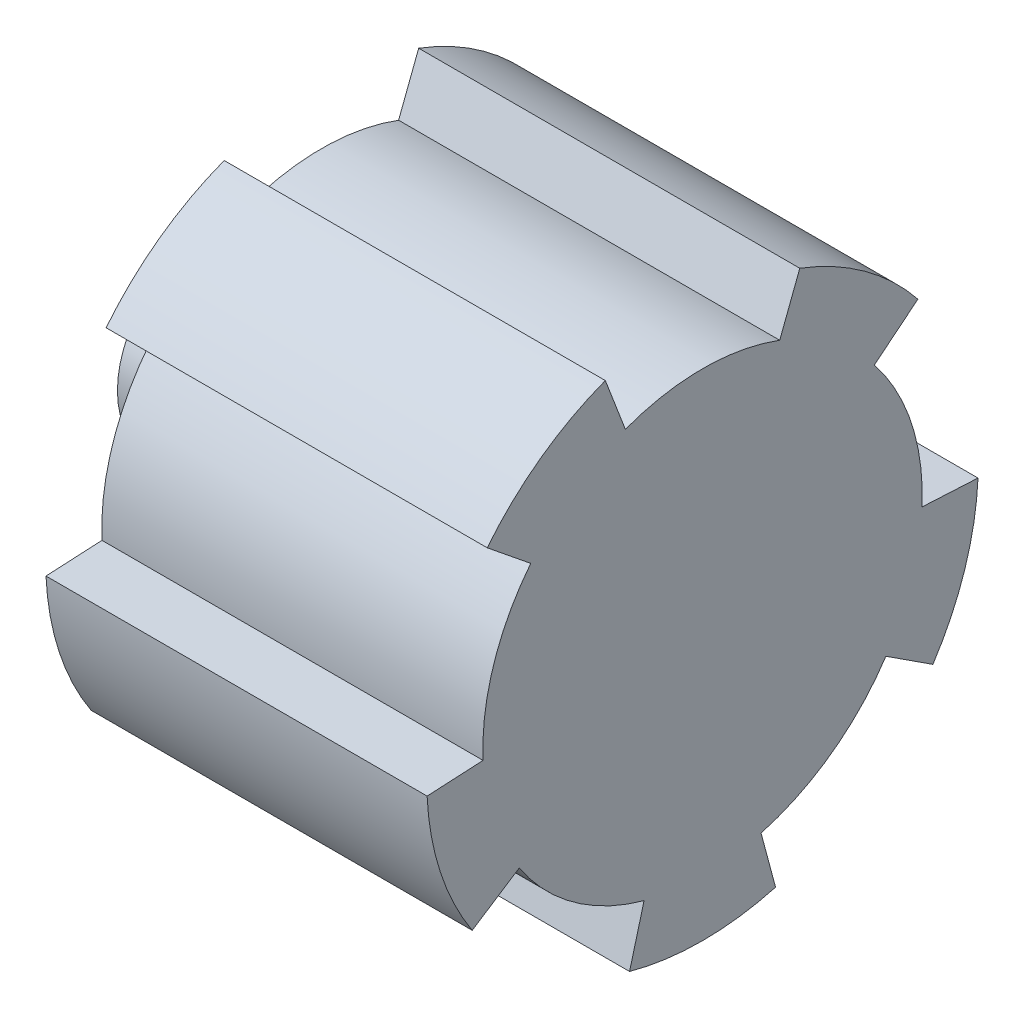
ISO-10303-21;
HEADER;
FILE_DESCRIPTION(('STEP AP214'),'2;1');
FILE_NAME('part.step','',(''),(''),'','','');
FILE_SCHEMA(('AUTOMOTIVE_DESIGN { 1 0 10303 214 1 1 1 1 }'));
ENDSEC;
DATA;
#1=APPLICATION_CONTEXT('core data for automotive mechanical design processes');
#2=APPLICATION_PROTOCOL_DEFINITION('international standard','automotive_design',2000,#1);
#3=PRODUCT_CONTEXT('',#1,'mechanical');
#4=PRODUCT('Part','Part','',(#3));
#5=PRODUCT_RELATED_PRODUCT_CATEGORY('part','',(#4));
#6=PRODUCT_DEFINITION_FORMATION('','',#4);
#7=PRODUCT_DEFINITION_CONTEXT('part definition',#1,'design');
#8=PRODUCT_DEFINITION('design','',#6,#7);
#9=PRODUCT_DEFINITION_SHAPE('','',#8);
#10=(LENGTH_UNIT() NAMED_UNIT(*) SI_UNIT(.MILLI.,.METRE.));
#11=(NAMED_UNIT(*) PLANE_ANGLE_UNIT() SI_UNIT($,.RADIAN.));
#12=(NAMED_UNIT(*) SI_UNIT($,.STERADIAN.) SOLID_ANGLE_UNIT());
#13=UNCERTAINTY_MEASURE_WITH_UNIT(LENGTH_MEASURE(1.E-05),#10,'distance_accuracy_value','');
#14=(GEOMETRIC_REPRESENTATION_CONTEXT(3) GLOBAL_UNCERTAINTY_ASSIGNED_CONTEXT((#13)) GLOBAL_UNIT_ASSIGNED_CONTEXT((#10,
#11,#12)) REPRESENTATION_CONTEXT('',''));
#15=CARTESIAN_POINT('',(0.,0.,0.));
#16=DIRECTION('',(0.,0.,1.));
#17=DIRECTION('',(1.,0.,0.));
#18=AXIS2_PLACEMENT_3D('',#15,#16,#17);
#19=CARTESIAN_POINT('',(-35.,0.,0.));
#20=DIRECTION('',(1.,0.,0.));
#21=DIRECTION('',(0.,0.,-1.));
#22=AXIS2_PLACEMENT_3D('',#19,#20,#21);
#23=CYLINDRICAL_SURFACE('',#22,9.8);
#24=CARTESIAN_POINT('',(-18.,0.,0.));
#25=DIRECTION('',(-1.,0.,0.));
#26=DIRECTION('',(0.,0.,1.));
#27=AXIS2_PLACEMENT_3D('',#24,#25,#26);
#28=CIRCLE('',#27,9.8);
#29=CARTESIAN_POINT('',(-18.,9.17573856950324,3.44177595205304));
#30=VERTEX_POINT('',#29);
#31=CARTESIAN_POINT('',(-18.,9.17573856950324,-3.44177595205303));
#32=VERTEX_POINT('',#31);
#33=EDGE_CURVE('E204',#30,#32,#28,.T.);
#34=ORIENTED_EDGE('',*,*,#33,.T.);
#35=DIRECTION('',(1.,0.,0.));
#36=VECTOR('',#35,1.);
#37=CARTESIAN_POINT('',(-35.,9.17573856950324,-3.44177595205303));
#38=LINE('',#37,#36);
#39=CARTESIAN_POINT('',(-35.,9.17573856950324,-3.44177595205303));
#40=VERTEX_POINT('',#39);
#41=EDGE_CURVE('E37',#40,#32,#38,.T.);
#42=ORIENTED_EDGE('',*,*,#41,.F.);
#43=CARTESIAN_POINT('',(-35.,0.,0.));
#44=DIRECTION('',(-1.,0.,0.));
#45=DIRECTION('',(0.,0.,1.));
#46=AXIS2_PLACEMENT_3D('',#43,#44,#45);
#47=CIRCLE('',#46,9.8);
#48=CARTESIAN_POINT('',(-35.,9.17573856950324,3.44177595205304));
#49=VERTEX_POINT('',#48);
#50=EDGE_CURVE('E243',#49,#40,#47,.T.);
#51=ORIENTED_EDGE('',*,*,#50,.F.);
#52=DIRECTION('',(1.,0.,0.));
#53=VECTOR('',#52,1.);
#54=CARTESIAN_POINT('',(-35.,9.17573856950324,3.44177595205304));
#55=LINE('',#54,#53);
#56=EDGE_CURVE('E200',#49,#30,#55,.T.);
#57=ORIENTED_EDGE('',*,*,#56,.T.);
#58=EDGE_LOOP('',(#34,#42,#51,#57));
#59=FACE_BOUND('',#58,.T.);
#60=ADVANCED_FACE('F34',(#59),#23,.T.);
#61=CARTESIAN_POINT('',(-35.,9.17573856950324,-3.44177595205303));
#62=DIRECTION('',(0.,-0.358367949545299,-0.933580426497202));
#63=DIRECTION('',(0.,0.933580426497203,-0.358367949545299));
#64=AXIS2_PLACEMENT_3D('',#61,#62,#63);
#65=PLANE('',#64);
#66=DIRECTION('',(0.,0.933580426497202,-0.358367949545299));
#67=VECTOR('',#66,1.);
#68=CARTESIAN_POINT('',(-18.,9.17573856950324,-3.44177595205303));
#69=LINE('',#68,#67);
#70=CARTESIAN_POINT('',(-18.,11.5090374790781,-4.33744548642617));
#71=VERTEX_POINT('',#70);
#72=EDGE_CURVE('E207',#32,#71,#69,.T.);
#73=ORIENTED_EDGE('',*,*,#72,.T.);
#74=DIRECTION('',(1.,0.,0.));
#75=VECTOR('',#74,1.);
#76=CARTESIAN_POINT('',(-35.,11.5090374790781,-4.33744548642617));
#77=LINE('',#76,#75);
#78=CARTESIAN_POINT('',(-35.,11.5090374790781,-4.33744548642617));
#79=VERTEX_POINT('',#78);
#80=EDGE_CURVE('E288',#79,#71,#77,.T.);
#81=ORIENTED_EDGE('',*,*,#80,.F.);
#82=DIRECTION('',(0.,0.933580426497202,-0.358367949545299));
#83=VECTOR('',#82,1.);
#84=CARTESIAN_POINT('',(-35.,9.17573856950324,-3.44177595205303));
#85=LINE('',#84,#83);
#86=EDGE_CURVE('E131',#40,#79,#85,.T.);
#87=ORIENTED_EDGE('',*,*,#86,.F.);
#88=ORIENTED_EDGE('',*,*,#41,.T.);
#89=EDGE_LOOP('',(#73,#81,#87,#88));
#90=FACE_BOUND('',#89,.T.);
#91=ADVANCED_FACE('F294',(#90),#65,.F.);
#92=CARTESIAN_POINT('',(-35.,0.,0.));
#93=DIRECTION('',(1.,0.,0.));
#94=DIRECTION('',(0.,0.,-1.));
#95=AXIS2_PLACEMENT_3D('',#92,#93,#94);
#96=CYLINDRICAL_SURFACE('',#95,12.2992429459111);
#97=CARTESIAN_POINT('',(-18.,0.,0.));
#98=DIRECTION('',(-1.,0.,0.));
#99=DIRECTION('',(0.,0.,1.));
#100=AXIS2_PLACEMENT_3D('',#97,#98,#99);
#101=CIRCLE('',#100,12.2992429459111);
#102=CARTESIAN_POINT('',(-18.,7.68164396387405,-9.60540072328169));
#103=VERTEX_POINT('',#102);
#104=EDGE_CURVE('E210',#71,#103,#101,.T.);
#105=ORIENTED_EDGE('',*,*,#104,.T.);
#106=DIRECTION('',(1.,0.,0.));
#107=VECTOR('',#106,1.);
#108=CARTESIAN_POINT('',(-35.,7.68164396387405,-9.60540072328169));
#109=LINE('',#108,#107);
#110=CARTESIAN_POINT('',(-35.,7.68164396387405,-9.60540072328169));
#111=VERTEX_POINT('',#110);
#112=EDGE_CURVE('E286',#111,#103,#109,.T.);
#113=ORIENTED_EDGE('',*,*,#112,.F.);
#114=CARTESIAN_POINT('',(-35.,0.,0.));
#115=DIRECTION('',(-1.,0.,0.));
#116=DIRECTION('',(0.,0.,1.));
#117=AXIS2_PLACEMENT_3D('',#114,#115,#116);
#118=CIRCLE('',#117,12.2992429459111);
#119=EDGE_CURVE('E311',#79,#111,#118,.T.);
#120=ORIENTED_EDGE('',*,*,#119,.F.);
#121=ORIENTED_EDGE('',*,*,#80,.T.);
#122=EDGE_LOOP('',(#105,#113,#120,#121));
#123=FACE_BOUND('',#122,.T.);
#124=ADVANCED_FACE('F303',(#123),#96,.T.);
#125=CARTESIAN_POINT('',(-35.,7.68164396387405,-9.60540072328169));
#126=DIRECTION('',(0.,0.777145961456966,0.629320391049844));
#127=DIRECTION('',(0.,-0.629320391049844,0.777145961456966));
#128=AXIS2_PLACEMENT_3D('',#125,#126,#127);
#129=PLANE('',#128);
#130=DIRECTION('',(0.,-0.629320391049843,0.777145961456966));
#131=VECTOR('',#130,1.);
#132=CARTESIAN_POINT('',(-18.,7.68164396387405,-9.60540072328169));
#133=LINE('',#132,#131);
#134=CARTESIAN_POINT('',(-18.,6.10878260074626,-7.66307869833136));
#135=VERTEX_POINT('',#134);
#136=EDGE_CURVE('E212',#103,#135,#133,.T.);
#137=ORIENTED_EDGE('',*,*,#136,.T.);
#138=DIRECTION('',(1.,0.,0.));
#139=VECTOR('',#138,1.);
#140=CARTESIAN_POINT('',(-35.,6.10878260074626,-7.66307869833136));
#141=LINE('',#140,#139);
#142=CARTESIAN_POINT('',(-35.,6.10878260074626,-7.66307869833136));
#143=VERTEX_POINT('',#142);
#144=EDGE_CURVE('E283',#143,#135,#141,.T.);
#145=ORIENTED_EDGE('',*,*,#144,.F.);
#146=DIRECTION('',(0.,-0.629320391049843,0.777145961456966));
#147=VECTOR('',#146,1.);
#148=CARTESIAN_POINT('',(-35.,7.68164396387405,-9.60540072328169));
#149=LINE('',#148,#147);
#150=EDGE_CURVE('E308',#111,#143,#149,.T.);
#151=ORIENTED_EDGE('',*,*,#150,.F.);
#152=ORIENTED_EDGE('',*,*,#112,.T.);
#153=EDGE_LOOP('',(#137,#145,#151,#152));
#154=FACE_BOUND('',#153,.T.);
#155=ADVANCED_FACE('F306',(#154),#129,.F.);
#156=CARTESIAN_POINT('',(-35.,0.,0.));
#157=DIRECTION('',(1.,0.,0.));
#158=DIRECTION('',(0.,0.,-1.));
#159=AXIS2_PLACEMENT_3D('',#156,#157,#158);
#160=CYLINDRICAL_SURFACE('',#159,9.8);
#161=CARTESIAN_POINT('',(-18.,0.,0.));
#162=DIRECTION('',(-1.,0.,0.));
#163=DIRECTION('',(0.,0.,1.));
#164=AXIS2_PLACEMENT_3D('',#161,#162,#163);
#165=CIRCLE('',#164,9.8);
#166=CARTESIAN_POINT('',(-18.,-0.437864292909845,-9.79021321836223));
#167=VERTEX_POINT('',#166);
#168=EDGE_CURVE('E214',#135,#167,#165,.T.);
#169=ORIENTED_EDGE('',*,*,#168,.T.);
#170=DIRECTION('',(1.,0.,0.));
#171=VECTOR('',#170,1.);
#172=CARTESIAN_POINT('',(-35.,-0.437864292909845,-9.79021321836223));
#173=LINE('',#172,#171);
#174=CARTESIAN_POINT('',(-35.,-0.437864292909845,-9.79021321836223));
#175=VERTEX_POINT('',#174);
#176=EDGE_CURVE('E280',#175,#167,#173,.T.);
#177=ORIENTED_EDGE('',*,*,#176,.F.);
#178=CARTESIAN_POINT('',(-35.,0.,0.));
#179=DIRECTION('',(-1.,0.,0.));
#180=DIRECTION('',(0.,0.,1.));
#181=AXIS2_PLACEMENT_3D('',#178,#179,#180);
#182=CIRCLE('',#181,9.8);
#183=EDGE_CURVE('E310',#143,#175,#182,.T.);
#184=ORIENTED_EDGE('',*,*,#183,.F.);
#185=ORIENTED_EDGE('',*,*,#144,.T.);
#186=EDGE_LOOP('',(#169,#177,#184,#185));
#187=FACE_BOUND('',#186,.T.);
#188=ADVANCED_FACE('F398',(#187),#160,.T.);
#189=CARTESIAN_POINT('',(-35.,-0.437864292909846,-9.79021321836223));
#190=DIRECTION('',(0.,-0.998629534754574,0.052335956242946));
#191=DIRECTION('',(0.,-0.052335956242946,-0.998629534754574));
#192=AXIS2_PLACEMENT_3D('',#189,#190,#191);
#193=PLANE('',#192);
#194=DIRECTION('',(0.,-0.052335956242946,-0.998629534754574));
#195=VECTOR('',#194,1.);
#196=CARTESIAN_POINT('',(-18.,-0.437864292909846,-9.79021321836223));
#197=LINE('',#196,#195);
#198=CARTESIAN_POINT('',(-18.,-0.568667624007308,-12.286089458243));
#199=VERTEX_POINT('',#198);
#200=EDGE_CURVE('E216',#167,#199,#197,.T.);
#201=ORIENTED_EDGE('',*,*,#200,.T.);
#202=DIRECTION('',(1.,0.,0.));
#203=VECTOR('',#202,1.);
#204=CARTESIAN_POINT('',(-35.,-0.568667624007308,-12.286089458243));
#205=LINE('',#204,#203);
#206=CARTESIAN_POINT('',(-35.,-0.568667624007308,-12.286089458243));
#207=VERTEX_POINT('',#206);
#208=EDGE_CURVE('E277',#207,#199,#205,.T.);
#209=ORIENTED_EDGE('',*,*,#208,.F.);
#210=DIRECTION('',(0.,-0.052335956242946,-0.998629534754574));
#211=VECTOR('',#210,1.);
#212=CARTESIAN_POINT('',(-35.,-0.437864292909846,-9.79021321836223));
#213=LINE('',#212,#211);
#214=EDGE_CURVE('E313',#175,#207,#213,.T.);
#215=ORIENTED_EDGE('',*,*,#214,.F.);
#216=ORIENTED_EDGE('',*,*,#176,.T.);
#217=EDGE_LOOP('',(#201,#209,#215,#216));
#218=FACE_BOUND('',#217,.T.);
#219=ADVANCED_FACE('F394',(#218),#193,.F.);
#220=CARTESIAN_POINT('',(-35.,0.,0.));
#221=DIRECTION('',(1.,0.,0.));
#222=DIRECTION('',(0.,0.,-1.));
#223=AXIS2_PLACEMENT_3D('',#220,#221,#222);
#224=CYLINDRICAL_SURFACE('',#223,12.2992429459111);
#225=CARTESIAN_POINT('',(-18.,0.,0.));
#226=DIRECTION('',(-1.,0.,0.));
#227=DIRECTION('',(0.,0.,1.));
#228=AXIS2_PLACEMENT_3D('',#225,#226,#227);
#229=CIRCLE('',#228,12.2992429459111);
#230=CARTESIAN_POINT('',(-18.,-6.76152041992843,-10.2739096089772));
#231=VERTEX_POINT('',#230);
#232=EDGE_CURVE('E218',#199,#231,#229,.T.);
#233=ORIENTED_EDGE('',*,*,#232,.T.);
#234=DIRECTION('',(1.,0.,0.));
#235=VECTOR('',#234,1.);
#236=CARTESIAN_POINT('',(-35.,-6.76152041992843,-10.2739096089772));
#237=LINE('',#236,#235);
#238=CARTESIAN_POINT('',(-35.,-6.76152041992843,-10.2739096089772));
#239=VERTEX_POINT('',#238);
#240=EDGE_CURVE('E274',#239,#231,#237,.T.);
#241=ORIENTED_EDGE('',*,*,#240,.F.);
#242=CARTESIAN_POINT('',(-35.,0.,0.));
#243=DIRECTION('',(-1.,0.,0.));
#244=DIRECTION('',(0.,0.,1.));
#245=AXIS2_PLACEMENT_3D('',#242,#243,#244);
#246=CIRCLE('',#245,12.2992429459111);
#247=EDGE_CURVE('E319',#207,#239,#246,.T.);
#248=ORIENTED_EDGE('',*,*,#247,.F.);
#249=ORIENTED_EDGE('',*,*,#208,.T.);
#250=EDGE_LOOP('',(#233,#241,#248,#249));
#251=FACE_BOUND('',#250,.T.);
#252=ADVANCED_FACE('F390',(#251),#224,.T.);
#253=CARTESIAN_POINT('',(-35.,-6.76152041992844,-10.2739096089772));
#254=DIRECTION('',(0.,0.838670567945428,-0.544639035015021));
#255=DIRECTION('',(0.,0.544639035015021,0.838670567945428));
#256=AXIS2_PLACEMENT_3D('',#253,#254,#255);
#257=PLANE('',#256);
#258=DIRECTION('',(0.,0.544639035015021,0.838670567945428));
#259=VECTOR('',#258,1.);
#260=CARTESIAN_POINT('',(-18.,-6.76152041992844,-10.2739096089772));
#261=LINE('',#260,#259);
#262=CARTESIAN_POINT('',(-18.,-5.40030329235806,-8.17781904608721));
#263=VERTEX_POINT('',#262);
#264=EDGE_CURVE('E220',#231,#263,#261,.T.);
#265=ORIENTED_EDGE('',*,*,#264,.T.);
#266=DIRECTION('',(1.,0.,0.));
#267=VECTOR('',#266,1.);
#268=CARTESIAN_POINT('',(-35.,-5.40030329235806,-8.17781904608721));
#269=LINE('',#268,#267);
#270=CARTESIAN_POINT('',(-35.,-5.40030329235806,-8.17781904608721));
#271=VERTEX_POINT('',#270);
#272=EDGE_CURVE('E271',#271,#263,#269,.T.);
#273=ORIENTED_EDGE('',*,*,#272,.F.);
#274=DIRECTION('',(0.,0.544639035015021,0.838670567945428));
#275=VECTOR('',#274,1.);
#276=CARTESIAN_POINT('',(-35.,-6.76152041992844,-10.2739096089772));
#277=LINE('',#276,#275);
#278=EDGE_CURVE('E321',#239,#271,#277,.T.);
#279=ORIENTED_EDGE('',*,*,#278,.F.);
#280=ORIENTED_EDGE('',*,*,#240,.T.);
#281=EDGE_LOOP('',(#265,#273,#279,#280));
#282=FACE_BOUND('',#281,.T.);
#283=ADVANCED_FACE('F386',(#282),#257,.F.);
#284=CARTESIAN_POINT('',(-35.,0.,0.));
#285=DIRECTION('',(1.,0.,0.));
#286=DIRECTION('',(0.,0.,-1.));
#287=AXIS2_PLACEMENT_3D('',#284,#285,#286);
#288=CYLINDRICAL_SURFACE('',#287,9.8);
#289=CARTESIAN_POINT('',(-18.,0.,0.));
#290=DIRECTION('',(-1.,0.,0.));
#291=DIRECTION('',(0.,0.,1.));
#292=AXIS2_PLACEMENT_3D('',#289,#290,#291);
#293=CIRCLE('',#292,9.8);
#294=CARTESIAN_POINT('',(-18.,-9.44635358498147,-2.60890857400328));
#295=VERTEX_POINT('',#294);
#296=EDGE_CURVE('E222',#263,#295,#293,.T.);
#297=ORIENTED_EDGE('',*,*,#296,.T.);
#298=DIRECTION('',(1.,0.,0.));
#299=VECTOR('',#298,1.);
#300=CARTESIAN_POINT('',(-35.,-9.44635358498147,-2.60890857400328));
#301=LINE('',#300,#299);
#302=CARTESIAN_POINT('',(-35.,-9.44635358498147,-2.60890857400328));
#303=VERTEX_POINT('',#302);
#304=EDGE_CURVE('E268',#303,#295,#301,.T.);
#305=ORIENTED_EDGE('',*,*,#304,.F.);
#306=CARTESIAN_POINT('',(-35.,0.,0.));
#307=DIRECTION('',(-1.,0.,0.));
#308=DIRECTION('',(0.,0.,1.));
#309=AXIS2_PLACEMENT_3D('',#306,#307,#308);
#310=CIRCLE('',#309,9.8);
#311=EDGE_CURVE('E323',#271,#303,#310,.T.);
#312=ORIENTED_EDGE('',*,*,#311,.F.);
#313=ORIENTED_EDGE('',*,*,#272,.T.);
#314=EDGE_LOOP('',(#297,#305,#312,#313));
#315=FACE_BOUND('',#314,.T.);
#316=ADVANCED_FACE('F381',(#315),#288,.T.);
#317=CARTESIAN_POINT('',(-35.,-9.44635358498147,-2.60890857400327));
#318=DIRECTION('',(0.,-0.258819045102516,0.96592582628907));
#319=DIRECTION('',(0.,-0.96592582628907,-0.258819045102515));
#320=AXIS2_PLACEMENT_3D('',#317,#318,#319);
#321=PLANE('',#320);
#322=DIRECTION('',(0.,-0.96592582628907,-0.258819045102515));
#323=VECTOR('',#322,1.);
#324=CARTESIAN_POINT('',(-18.,-9.44635358498147,-2.60890857400327));
#325=LINE('',#324,#323);
#326=CARTESIAN_POINT('',(-18.,-11.8604933990163,-3.2557753875897));
#327=VERTEX_POINT('',#326);
#328=EDGE_CURVE('E224',#295,#327,#325,.T.);
#329=ORIENTED_EDGE('',*,*,#328,.T.);
#330=DIRECTION('',(1.,0.,0.));
#331=VECTOR('',#330,1.);
#332=CARTESIAN_POINT('',(-35.,-11.8604933990163,-3.2557753875897));
#333=LINE('',#332,#331);
#334=CARTESIAN_POINT('',(-35.,-11.8604933990163,-3.2557753875897));
#335=VERTEX_POINT('',#334);
#336=EDGE_CURVE('E265',#335,#327,#333,.T.);
#337=ORIENTED_EDGE('',*,*,#336,.F.);
#338=DIRECTION('',(0.,-0.96592582628907,-0.258819045102515));
#339=VECTOR('',#338,1.);
#340=CARTESIAN_POINT('',(-35.,-9.44635358498147,-2.60890857400327));
#341=LINE('',#340,#339);
#342=EDGE_CURVE('E325',#303,#335,#341,.T.);
#343=ORIENTED_EDGE('',*,*,#342,.F.);
#344=ORIENTED_EDGE('',*,*,#304,.T.);
#345=EDGE_LOOP('',(#329,#337,#343,#344));
#346=FACE_BOUND('',#345,.T.);
#347=ADVANCED_FACE('F375',(#346),#321,.F.);
#348=CARTESIAN_POINT('',(-35.,0.,0.));
#349=DIRECTION('',(1.,0.,0.));
#350=DIRECTION('',(0.,0.,-1.));
#351=AXIS2_PLACEMENT_3D('',#348,#349,#350);
#352=CYLINDRICAL_SURFACE('',#351,12.2992429459111);
#353=CARTESIAN_POINT('',(-18.,0.,0.));
#354=DIRECTION('',(-1.,0.,0.));
#355=DIRECTION('',(0.,0.,1.));
#356=AXIS2_PLACEMENT_3D('',#353,#354,#355);
#357=CIRCLE('',#356,12.2992429459111);
#358=CARTESIAN_POINT('',(-18.,-11.8604933990163,3.2557753875897));
#359=VERTEX_POINT('',#358);
#360=EDGE_CURVE('E226',#327,#359,#357,.T.);
#361=ORIENTED_EDGE('',*,*,#360,.T.);
#362=DIRECTION('',(1.,0.,0.));
#363=VECTOR('',#362,1.);
#364=CARTESIAN_POINT('',(-35.,-11.8604933990163,3.2557753875897));
#365=LINE('',#364,#363);
#366=CARTESIAN_POINT('',(-35.,-11.8604933990163,3.2557753875897));
#367=VERTEX_POINT('',#366);
#368=EDGE_CURVE('E262',#367,#359,#365,.T.);
#369=ORIENTED_EDGE('',*,*,#368,.F.);
#370=CARTESIAN_POINT('',(-35.,0.,0.));
#371=DIRECTION('',(-1.,0.,0.));
#372=DIRECTION('',(0.,0.,1.));
#373=AXIS2_PLACEMENT_3D('',#370,#371,#372);
#374=CIRCLE('',#373,12.2992429459111);
#375=EDGE_CURVE('E327',#335,#367,#374,.T.);
#376=ORIENTED_EDGE('',*,*,#375,.F.);
#377=ORIENTED_EDGE('',*,*,#336,.T.);
#378=EDGE_LOOP('',(#361,#369,#376,#377));
#379=FACE_BOUND('',#378,.T.);
#380=ADVANCED_FACE('F371',(#379),#352,.T.);
#381=CARTESIAN_POINT('',(-35.,-11.8604933990163,3.2557753875897));
#382=DIRECTION('',(0.,-0.258819045102519,-0.965925826289069));
#383=DIRECTION('',(0.,0.965925826289069,-0.258819045102519));
#384=AXIS2_PLACEMENT_3D('',#381,#382,#383);
#385=PLANE('',#384);
#386=DIRECTION('',(0.,0.965925826289069,-0.258819045102519));
#387=VECTOR('',#386,1.);
#388=CARTESIAN_POINT('',(-18.,-11.8604933990163,3.2557753875897));
#389=LINE('',#388,#387);
#390=CARTESIAN_POINT('',(-18.,-9.44635358498147,2.60890857400327));
#391=VERTEX_POINT('',#390);
#392=EDGE_CURVE('E228',#359,#391,#389,.T.);
#393=ORIENTED_EDGE('',*,*,#392,.T.);
#394=DIRECTION('',(1.,0.,0.));
#395=VECTOR('',#394,1.);
#396=CARTESIAN_POINT('',(-35.,-9.44635358498147,2.60890857400327));
#397=LINE('',#396,#395);
#398=CARTESIAN_POINT('',(-35.,-9.44635358498147,2.60890857400327));
#399=VERTEX_POINT('',#398);
#400=EDGE_CURVE('E259',#399,#391,#397,.T.);
#401=ORIENTED_EDGE('',*,*,#400,.F.);
#402=DIRECTION('',(0.,0.965925826289069,-0.258819045102519));
#403=VECTOR('',#402,1.);
#404=CARTESIAN_POINT('',(-35.,-11.8604933990163,3.2557753875897));
#405=LINE('',#404,#403);
#406=EDGE_CURVE('E329',#367,#399,#405,.T.);
#407=ORIENTED_EDGE('',*,*,#406,.F.);
#408=ORIENTED_EDGE('',*,*,#368,.T.);
#409=EDGE_LOOP('',(#393,#401,#407,#408));
#410=FACE_BOUND('',#409,.T.);
#411=ADVANCED_FACE('F366',(#410),#385,.F.);
#412=CARTESIAN_POINT('',(-35.,0.,0.));
#413=DIRECTION('',(1.,0.,0.));
#414=DIRECTION('',(0.,0.,-1.));
#415=AXIS2_PLACEMENT_3D('',#412,#413,#414);
#416=CYLINDRICAL_SURFACE('',#415,9.8);
#417=CARTESIAN_POINT('',(-18.,0.,0.));
#418=DIRECTION('',(-1.,0.,0.));
#419=DIRECTION('',(0.,0.,1.));
#420=AXIS2_PLACEMENT_3D('',#417,#418,#419);
#421=CIRCLE('',#420,9.8);
#422=CARTESIAN_POINT('',(-18.,-5.40030329235807,8.1778190460872));
#423=VERTEX_POINT('',#422);
#424=EDGE_CURVE('E230',#391,#423,#421,.T.);
#425=ORIENTED_EDGE('',*,*,#424,.T.);
#426=DIRECTION('',(1.,0.,0.));
#427=VECTOR('',#426,1.);
#428=CARTESIAN_POINT('',(-35.,-5.40030329235807,8.1778190460872));
#429=LINE('',#428,#427);
#430=CARTESIAN_POINT('',(-35.,-5.40030329235807,8.1778190460872));
#431=VERTEX_POINT('',#430);
#432=EDGE_CURVE('E256',#431,#423,#429,.T.);
#433=ORIENTED_EDGE('',*,*,#432,.F.);
#434=CARTESIAN_POINT('',(-35.,0.,0.));
#435=DIRECTION('',(-1.,0.,0.));
#436=DIRECTION('',(0.,0.,1.));
#437=AXIS2_PLACEMENT_3D('',#434,#435,#436);
#438=CIRCLE('',#437,9.8);
#439=EDGE_CURVE('E331',#399,#431,#438,.T.);
#440=ORIENTED_EDGE('',*,*,#439,.F.);
#441=ORIENTED_EDGE('',*,*,#400,.T.);
#442=EDGE_LOOP('',(#425,#433,#440,#441));
#443=FACE_BOUND('',#442,.T.);
#444=ADVANCED_FACE('F360',(#443),#416,.T.);
#445=CARTESIAN_POINT('',(-35.,-5.40030329235807,8.17781904608721));
#446=DIRECTION('',(0.,0.838670567945428,0.544639035015021));
#447=DIRECTION('',(0.,-0.544639035015021,0.838670567945428));
#448=AXIS2_PLACEMENT_3D('',#445,#446,#447);
#449=PLANE('',#448);
#450=DIRECTION('',(0.,-0.544639035015021,0.838670567945428));
#451=VECTOR('',#450,1.);
#452=CARTESIAN_POINT('',(-18.,-5.40030329235807,8.17781904608721));
#453=LINE('',#452,#451);
#454=CARTESIAN_POINT('',(-18.,-6.76152041992844,10.2739096089772));
#455=VERTEX_POINT('',#454);
#456=EDGE_CURVE('E232',#423,#455,#453,.T.);
#457=ORIENTED_EDGE('',*,*,#456,.T.);
#458=DIRECTION('',(1.,0.,0.));
#459=VECTOR('',#458,1.);
#460=CARTESIAN_POINT('',(-35.,-6.76152041992844,10.2739096089772));
#461=LINE('',#460,#459);
#462=CARTESIAN_POINT('',(-35.,-6.76152041992844,10.2739096089772));
#463=VERTEX_POINT('',#462);
#464=EDGE_CURVE('E253',#463,#455,#461,.T.);
#465=ORIENTED_EDGE('',*,*,#464,.F.);
#466=DIRECTION('',(0.,-0.544639035015021,0.838670567945428));
#467=VECTOR('',#466,1.);
#468=CARTESIAN_POINT('',(-35.,-5.40030329235807,8.17781904608721));
#469=LINE('',#468,#467);
#470=EDGE_CURVE('E333',#431,#463,#469,.T.);
#471=ORIENTED_EDGE('',*,*,#470,.F.);
#472=ORIENTED_EDGE('',*,*,#432,.T.);
#473=EDGE_LOOP('',(#457,#465,#471,#472));
#474=FACE_BOUND('',#473,.T.);
#475=ADVANCED_FACE('F356',(#474),#449,.F.);
#476=CARTESIAN_POINT('',(-35.,0.,0.));
#477=DIRECTION('',(1.,0.,0.));
#478=DIRECTION('',(0.,0.,-1.));
#479=AXIS2_PLACEMENT_3D('',#476,#477,#478);
#480=CYLINDRICAL_SURFACE('',#479,12.2992429459111);
#481=CARTESIAN_POINT('',(-18.,0.,0.));
#482=DIRECTION('',(-1.,0.,0.));
#483=DIRECTION('',(0.,0.,1.));
#484=AXIS2_PLACEMENT_3D('',#481,#482,#483);
#485=CIRCLE('',#484,12.2992429459111);
#486=CARTESIAN_POINT('',(-18.,-0.568667624007312,12.286089458243));
#487=VERTEX_POINT('',#486);
#488=EDGE_CURVE('E234',#455,#487,#485,.T.);
#489=ORIENTED_EDGE('',*,*,#488,.T.);
#490=DIRECTION('',(1.,0.,0.));
#491=VECTOR('',#490,1.);
#492=CARTESIAN_POINT('',(-35.,-0.568667624007312,12.286089458243));
#493=LINE('',#492,#491);
#494=CARTESIAN_POINT('',(-35.,-0.568667624007312,12.286089458243));
#495=VERTEX_POINT('',#494);
#496=EDGE_CURVE('E250',#495,#487,#493,.T.);
#497=ORIENTED_EDGE('',*,*,#496,.F.);
#498=CARTESIAN_POINT('',(-35.,0.,0.));
#499=DIRECTION('',(-1.,0.,0.));
#500=DIRECTION('',(0.,0.,1.));
#501=AXIS2_PLACEMENT_3D('',#498,#499,#500);
#502=CIRCLE('',#501,12.2992429459111);
#503=EDGE_CURVE('E335',#463,#495,#502,.T.);
#504=ORIENTED_EDGE('',*,*,#503,.F.);
#505=ORIENTED_EDGE('',*,*,#464,.T.);
#506=EDGE_LOOP('',(#489,#497,#504,#505));
#507=FACE_BOUND('',#506,.T.);
#508=ADVANCED_FACE('F352',(#507),#480,.T.);
#509=CARTESIAN_POINT('',(-35.,-0.568667624007308,12.286089458243));
#510=DIRECTION('',(0.,-0.998629534754574,-0.0523359562429448));
#511=DIRECTION('',(0.,0.0523359562429448,-0.998629534754574));
#512=AXIS2_PLACEMENT_3D('',#509,#510,#511);
#513=PLANE('',#512);
#514=DIRECTION('',(0.,0.0523359562429448,-0.998629534754574));
#515=VECTOR('',#514,1.);
#516=CARTESIAN_POINT('',(-18.,-0.568667624007308,12.286089458243));
#517=LINE('',#516,#515);
#518=CARTESIAN_POINT('',(-18.,-0.437864292909849,9.79021321836223));
#519=VERTEX_POINT('',#518);
#520=EDGE_CURVE('E236',#487,#519,#517,.T.);
#521=ORIENTED_EDGE('',*,*,#520,.T.);
#522=DIRECTION('',(1.,0.,0.));
#523=VECTOR('',#522,1.);
#524=CARTESIAN_POINT('',(-35.,-0.437864292909849,9.79021321836223));
#525=LINE('',#524,#523);
#526=CARTESIAN_POINT('',(-35.,-0.437864292909849,9.79021321836223));
#527=VERTEX_POINT('',#526);
#528=EDGE_CURVE('E247',#527,#519,#525,.T.);
#529=ORIENTED_EDGE('',*,*,#528,.F.);
#530=DIRECTION('',(0.,0.0523359562429448,-0.998629534754574));
#531=VECTOR('',#530,1.);
#532=CARTESIAN_POINT('',(-35.,-0.568667624007308,12.286089458243));
#533=LINE('',#532,#531);
#534=EDGE_CURVE('E337',#495,#527,#533,.T.);
#535=ORIENTED_EDGE('',*,*,#534,.F.);
#536=ORIENTED_EDGE('',*,*,#496,.T.);
#537=EDGE_LOOP('',(#521,#529,#535,#536));
#538=FACE_BOUND('',#537,.T.);
#539=ADVANCED_FACE('F343',(#538),#513,.F.);
#540=CARTESIAN_POINT('',(-35.,0.,0.));
#541=DIRECTION('',(1.,0.,0.));
#542=DIRECTION('',(0.,0.,-1.));
#543=AXIS2_PLACEMENT_3D('',#540,#541,#542);
#544=CYLINDRICAL_SURFACE('',#543,9.8);
#545=CARTESIAN_POINT('',(-18.,0.,0.));
#546=DIRECTION('',(-1.,0.,0.));
#547=DIRECTION('',(0.,0.,1.));
#548=AXIS2_PLACEMENT_3D('',#545,#546,#547);
#549=CIRCLE('',#548,9.8);
#550=CARTESIAN_POINT('',(-18.,6.10878260074626,7.66307869833136));
#551=VERTEX_POINT('',#550);
#552=EDGE_CURVE('E238',#519,#551,#549,.T.);
#553=ORIENTED_EDGE('',*,*,#552,.T.);
#554=DIRECTION('',(1.,0.,0.));
#555=VECTOR('',#554,1.);
#556=CARTESIAN_POINT('',(-35.,6.10878260074626,7.66307869833136));
#557=LINE('',#556,#555);
#558=CARTESIAN_POINT('',(-35.,6.10878260074626,7.66307869833136));
#559=VERTEX_POINT('',#558);
#560=EDGE_CURVE('E195',#559,#551,#557,.T.);
#561=ORIENTED_EDGE('',*,*,#560,.F.);
#562=CARTESIAN_POINT('',(-35.,0.,0.));
#563=DIRECTION('',(-1.,0.,0.));
#564=DIRECTION('',(0.,0.,1.));
#565=AXIS2_PLACEMENT_3D('',#562,#563,#564);
#566=CIRCLE('',#565,9.8);
#567=EDGE_CURVE('E186',#527,#559,#566,.T.);
#568=ORIENTED_EDGE('',*,*,#567,.F.);
#569=ORIENTED_EDGE('',*,*,#528,.T.);
#570=EDGE_LOOP('',(#553,#561,#568,#569));
#571=FACE_BOUND('',#570,.T.);
#572=ADVANCED_FACE('F347',(#571),#544,.T.);
#573=CARTESIAN_POINT('',(-35.,6.10878260074625,7.66307869833136));
#574=DIRECTION('',(0.,0.777145961456965,-0.629320391049844));
#575=DIRECTION('',(0.,0.629320391049844,0.777145961456965));
#576=AXIS2_PLACEMENT_3D('',#573,#574,#575);
#577=PLANE('',#576);
#578=DIRECTION('',(0.,0.629320391049844,0.777145961456965));
#579=VECTOR('',#578,1.);
#580=CARTESIAN_POINT('',(-18.,6.10878260074625,7.66307869833136));
#581=LINE('',#580,#579);
#582=CARTESIAN_POINT('',(-18.,7.68164396387405,9.60540072328169));
#583=VERTEX_POINT('',#582);
#584=EDGE_CURVE('E194',#551,#583,#581,.T.);
#585=ORIENTED_EDGE('',*,*,#584,.T.);
#586=DIRECTION('',(1.,0.,0.));
#587=VECTOR('',#586,1.);
#588=CARTESIAN_POINT('',(-35.,7.68164396387405,9.60540072328169));
#589=LINE('',#588,#587);
#590=CARTESIAN_POINT('',(-35.,7.68164396387405,9.60540072328169));
#591=VERTEX_POINT('',#590);
#592=EDGE_CURVE('E191',#591,#583,#589,.T.);
#593=ORIENTED_EDGE('',*,*,#592,.F.);
#594=DIRECTION('',(0.,0.629320391049844,0.777145961456965));
#595=VECTOR('',#594,1.);
#596=CARTESIAN_POINT('',(-35.,6.10878260074625,7.66307869833136));
#597=LINE('',#596,#595);
#598=EDGE_CURVE('E180',#559,#591,#597,.T.);
#599=ORIENTED_EDGE('',*,*,#598,.F.);
#600=ORIENTED_EDGE('',*,*,#560,.T.);
#601=EDGE_LOOP('',(#585,#593,#599,#600));
#602=FACE_BOUND('',#601,.T.);
#603=ADVANCED_FACE('F192',(#602),#577,.F.);
#604=CARTESIAN_POINT('',(-35.,0.,0.));
#605=DIRECTION('',(1.,0.,0.));
#606=DIRECTION('',(0.,0.,-1.));
#607=AXIS2_PLACEMENT_3D('',#604,#605,#606);
#608=CYLINDRICAL_SURFACE('',#607,12.2992429459111);
#609=CARTESIAN_POINT('',(-18.,0.,0.));
#610=DIRECTION('',(-1.,0.,0.));
#611=DIRECTION('',(0.,0.,1.));
#612=AXIS2_PLACEMENT_3D('',#609,#610,#611);
#613=CIRCLE('',#612,12.2992429459111);
#614=CARTESIAN_POINT('',(-18.,11.5090374790781,4.33744548642617));
#615=VERTEX_POINT('',#614);
#616=EDGE_CURVE('E116',#583,#615,#613,.T.);
#617=ORIENTED_EDGE('',*,*,#616,.T.);
#618=DIRECTION('',(1.,0.,0.));
#619=VECTOR('',#618,1.);
#620=CARTESIAN_POINT('',(-35.,11.5090374790781,4.33744548642617));
#621=LINE('',#620,#619);
#622=CARTESIAN_POINT('',(-35.,11.5090374790781,4.33744548642617));
#623=VERTEX_POINT('',#622);
#624=EDGE_CURVE('E196',#623,#615,#621,.T.);
#625=ORIENTED_EDGE('',*,*,#624,.F.);
#626=CARTESIAN_POINT('',(-35.,0.,0.));
#627=DIRECTION('',(-1.,0.,0.));
#628=DIRECTION('',(0.,0.,1.));
#629=AXIS2_PLACEMENT_3D('',#626,#627,#628);
#630=CIRCLE('',#629,12.2992429459111);
#631=EDGE_CURVE('E184',#591,#623,#630,.T.);
#632=ORIENTED_EDGE('',*,*,#631,.F.);
#633=ORIENTED_EDGE('',*,*,#592,.T.);
#634=EDGE_LOOP('',(#617,#625,#632,#633));
#635=FACE_BOUND('',#634,.T.);
#636=ADVANCED_FACE('F198',(#635),#608,.T.);
#637=CARTESIAN_POINT('',(-35.,11.5090374790781,4.33744548642617));
#638=DIRECTION('',(0.,-0.358367949545297,0.933580426497203));
#639=DIRECTION('',(0.,-0.933580426497203,-0.358367949545297));
#640=AXIS2_PLACEMENT_3D('',#637,#638,#639);
#641=PLANE('',#640);
#642=DIRECTION('',(0.,-0.933580426497203,-0.358367949545297));
#643=VECTOR('',#642,1.);
#644=CARTESIAN_POINT('',(-18.,11.5090374790781,4.33744548642617));
#645=LINE('',#644,#643);
#646=EDGE_CURVE('E122',#615,#30,#645,.T.);
#647=ORIENTED_EDGE('',*,*,#646,.T.);
#648=ORIENTED_EDGE('',*,*,#56,.F.);
#649=DIRECTION('',(0.,-0.933580426497203,-0.358367949545297));
#650=VECTOR('',#649,1.);
#651=CARTESIAN_POINT('',(-35.,11.5090374790781,4.33744548642617));
#652=LINE('',#651,#650);
#653=EDGE_CURVE('E51',#623,#49,#652,.T.);
#654=ORIENTED_EDGE('',*,*,#653,.F.);
#655=ORIENTED_EDGE('',*,*,#624,.T.);
#656=EDGE_LOOP('',(#647,#648,#654,#655));
#657=FACE_BOUND('',#656,.T.);
#658=ADVANCED_FACE('F536',(#657),#641,.F.);
#659=CARTESIAN_POINT('',(-35.,0.,0.));
#660=DIRECTION('',(-1.,0.,0.));
#661=DIRECTION('',(0.,0.,1.));
#662=AXIS2_PLACEMENT_3D('',#659,#660,#661);
#663=PLANE('',#662);
#664=CARTESIAN_POINT('',(-35.,0.,0.));
#665=DIRECTION('',(-1.,0.,0.));
#666=DIRECTION('',(0.,0.,1.));
#667=AXIS2_PLACEMENT_3D('',#664,#665,#666);
#668=CIRCLE('',#667,4.1);
#669=CARTESIAN_POINT('',(-35.,0.,4.1));
#670=VERTEX_POINT('',#669);
#671=EDGE_CURVE('E11',#670,#670,#668,.T.);
#672=ORIENTED_EDGE('',*,*,#671,.F.);
#673=EDGE_LOOP('',(#672));
#674=FACE_BOUND('',#673,.T.);
#675=ORIENTED_EDGE('',*,*,#50,.T.);
#676=ORIENTED_EDGE('',*,*,#86,.T.);
#677=ORIENTED_EDGE('',*,*,#119,.T.);
#678=ORIENTED_EDGE('',*,*,#150,.T.);
#679=ORIENTED_EDGE('',*,*,#183,.T.);
#680=ORIENTED_EDGE('',*,*,#214,.T.);
#681=ORIENTED_EDGE('',*,*,#247,.T.);
#682=ORIENTED_EDGE('',*,*,#278,.T.);
#683=ORIENTED_EDGE('',*,*,#311,.T.);
#684=ORIENTED_EDGE('',*,*,#342,.T.);
#685=ORIENTED_EDGE('',*,*,#375,.T.);
#686=ORIENTED_EDGE('',*,*,#406,.T.);
#687=ORIENTED_EDGE('',*,*,#439,.T.);
#688=ORIENTED_EDGE('',*,*,#470,.T.);
#689=ORIENTED_EDGE('',*,*,#503,.T.);
#690=ORIENTED_EDGE('',*,*,#534,.T.);
#691=ORIENTED_EDGE('',*,*,#567,.T.);
#692=ORIENTED_EDGE('',*,*,#598,.T.);
#693=ORIENTED_EDGE('',*,*,#631,.T.);
#694=ORIENTED_EDGE('',*,*,#653,.T.);
#695=EDGE_LOOP('',(#675,#676,#677,#678,#679,#680,#681,#682,#683,#684,#685,#686,#687,#688,#689,
#690,#691,#692,#693,#694));
#696=FACE_BOUND('',#695,.T.);
#697=ADVANCED_FACE('F182',(#674,#696),#663,.T.);
#698=CARTESIAN_POINT('',(-18.,0.,0.));
#699=DIRECTION('',(-1.,0.,0.));
#700=DIRECTION('',(0.,0.,1.));
#701=AXIS2_PLACEMENT_3D('',#698,#699,#700);
#702=PLANE('',#701);
#703=ORIENTED_EDGE('',*,*,#33,.F.);
#704=ORIENTED_EDGE('',*,*,#646,.F.);
#705=ORIENTED_EDGE('',*,*,#616,.F.);
#706=ORIENTED_EDGE('',*,*,#584,.F.);
#707=ORIENTED_EDGE('',*,*,#552,.F.);
#708=ORIENTED_EDGE('',*,*,#520,.F.);
#709=ORIENTED_EDGE('',*,*,#488,.F.);
#710=ORIENTED_EDGE('',*,*,#456,.F.);
#711=ORIENTED_EDGE('',*,*,#424,.F.);
#712=ORIENTED_EDGE('',*,*,#392,.F.);
#713=ORIENTED_EDGE('',*,*,#360,.F.);
#714=ORIENTED_EDGE('',*,*,#328,.F.);
#715=ORIENTED_EDGE('',*,*,#296,.F.);
#716=ORIENTED_EDGE('',*,*,#264,.F.);
#717=ORIENTED_EDGE('',*,*,#232,.F.);
#718=ORIENTED_EDGE('',*,*,#200,.F.);
#719=ORIENTED_EDGE('',*,*,#168,.F.);
#720=ORIENTED_EDGE('',*,*,#136,.F.);
#721=ORIENTED_EDGE('',*,*,#104,.F.);
#722=ORIENTED_EDGE('',*,*,#72,.F.);
#723=EDGE_LOOP('',(#703,#704,#705,#706,#707,#708,#709,#710,#711,#712,#713,#714,#715,#716,#717,
#718,#719,#720,#721,#722));
#724=FACE_BOUND('',#723,.T.);
#725=ADVANCED_FACE('F299',(#724),#702,.F.);
#726=CARTESIAN_POINT('',(-40.,0.,0.));
#727=DIRECTION('',(1.,0.,0.));
#728=DIRECTION('',(0.,0.,-1.));
#729=AXIS2_PLACEMENT_3D('',#726,#727,#728);
#730=CYLINDRICAL_SURFACE('',#729,4.1);
#731=CARTESIAN_POINT('',(-40.,0.,0.));
#732=DIRECTION('',(-1.,0.,0.));
#733=DIRECTION('',(0.,0.,1.));
#734=AXIS2_PLACEMENT_3D('',#731,#732,#733);
#735=CIRCLE('',#734,4.1);
#736=CARTESIAN_POINT('',(-40.,0.,4.1));
#737=VERTEX_POINT('',#736);
#738=EDGE_CURVE('E208',#737,#737,#735,.T.);
#739=ORIENTED_EDGE('',*,*,#738,.F.);
#740=EDGE_LOOP('',(#739));
#741=FACE_BOUND('',#740,.T.);
#742=ORIENTED_EDGE('',*,*,#671,.T.);
#743=EDGE_LOOP('',(#742));
#744=FACE_BOUND('',#743,.T.);
#745=ADVANCED_FACE('F563',(#741,#744),#730,.T.);
#746=CARTESIAN_POINT('',(-40.,0.,0.));
#747=DIRECTION('',(-1.,0.,0.));
#748=DIRECTION('',(0.,0.,1.));
#749=AXIS2_PLACEMENT_3D('',#746,#747,#748);
#750=PLANE('',#749);
#751=ORIENTED_EDGE('',*,*,#738,.T.);
#752=EDGE_LOOP('',(#751));
#753=FACE_BOUND('',#752,.T.);
#754=ADVANCED_FACE('F571',(#753),#750,.T.);
#755=CLOSED_SHELL('',(#60,#91,#124,#155,#188,#219,#252,#283,#316,#347,#380,#411,#444,#475,#508,
#539,#572,#603,#636,#658,#697,#725,#745,#754));
#756=MANIFOLD_SOLID_BREP('B2',#755);
#757=ADVANCED_BREP_SHAPE_REPRESENTATION('',(#18,#756),#14);
#758=SHAPE_DEFINITION_REPRESENTATION(#9,#757);
ENDSEC;
END-ISO-10303-21;
